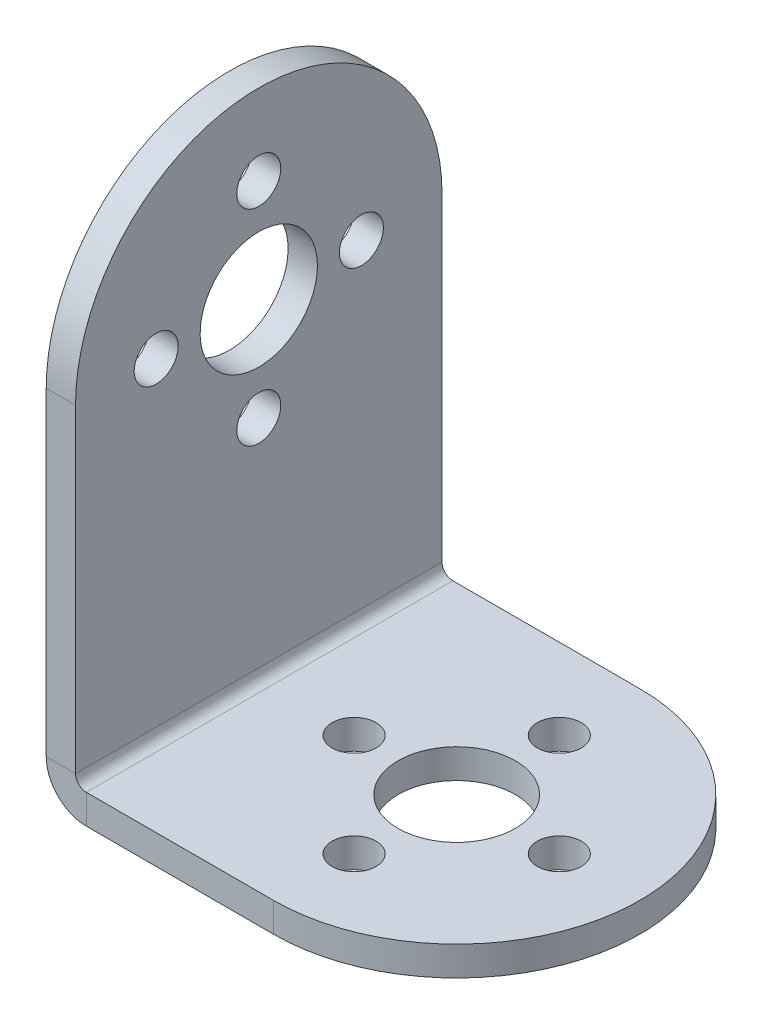
ISO-10303-21;
HEADER;
FILE_DESCRIPTION(('STEP AP214'),'2;1');
FILE_NAME('part.step','',(''),(''),'','','');
FILE_SCHEMA(('AUTOMOTIVE_DESIGN { 1 0 10303 214 1 1 1 1 }'));
ENDSEC;
DATA;
#1=APPLICATION_CONTEXT('core data for automotive mechanical design processes');
#2=APPLICATION_PROTOCOL_DEFINITION('international standard','automotive_design',2000,#1);
#3=PRODUCT_CONTEXT('',#1,'mechanical');
#4=PRODUCT('Part','Part','',(#3));
#5=PRODUCT_RELATED_PRODUCT_CATEGORY('part','',(#4));
#6=PRODUCT_DEFINITION_FORMATION('','',#4);
#7=PRODUCT_DEFINITION_CONTEXT('part definition',#1,'design');
#8=PRODUCT_DEFINITION('design','',#6,#7);
#9=PRODUCT_DEFINITION_SHAPE('','',#8);
#10=(LENGTH_UNIT() NAMED_UNIT(*) SI_UNIT(.MILLI.,.METRE.));
#11=(NAMED_UNIT(*) PLANE_ANGLE_UNIT() SI_UNIT($,.RADIAN.));
#12=(NAMED_UNIT(*) SI_UNIT($,.STERADIAN.) SOLID_ANGLE_UNIT());
#13=UNCERTAINTY_MEASURE_WITH_UNIT(LENGTH_MEASURE(1.E-05),#10,'distance_accuracy_value','');
#14=(GEOMETRIC_REPRESENTATION_CONTEXT(3) GLOBAL_UNCERTAINTY_ASSIGNED_CONTEXT((#13)) GLOBAL_UNIT_ASSIGNED_CONTEXT((#10,
#11,#12)) REPRESENTATION_CONTEXT('',''));
#15=CARTESIAN_POINT('',(0.,0.,0.));
#16=DIRECTION('',(0.,0.,1.));
#17=DIRECTION('',(1.,0.,0.));
#18=AXIS2_PLACEMENT_3D('',#15,#16,#17);
#19=CARTESIAN_POINT('',(-14.,0.,0.));
#20=DIRECTION('',(1.,0.,0.));
#21=DIRECTION('',(0.,1.,0.));
#22=AXIS2_PLACEMENT_3D('',#19,#20,#21);
#23=PLANE('',#22);
#24=CARTESIAN_POINT('',(-14.0000000000002,24.5,7.));
#25=DIRECTION('',(1.,0.,0.));
#26=DIRECTION('',(0.,1.,0.));
#27=AXIS2_PLACEMENT_3D('',#24,#25,#26);
#28=CIRCLE('',#27,1.5);
#29=CARTESIAN_POINT('',(-14.0000000000002,26.,7.));
#30=VERTEX_POINT('',#29);
#31=EDGE_CURVE('E475',#30,#30,#28,.T.);
#32=ORIENTED_EDGE('',*,*,#31,.T.);
#33=EDGE_LOOP('',(#32));
#34=FACE_BOUND('',#33,.T.);
#35=CARTESIAN_POINT('',(-14.0000000000002,17.5,0.));
#36=DIRECTION('',(1.,0.,0.));
#37=DIRECTION('',(0.,1.,0.));
#38=AXIS2_PLACEMENT_3D('',#35,#36,#37);
#39=CIRCLE('',#38,1.5);
#40=CARTESIAN_POINT('',(-14.0000000000002,19.,0.));
#41=VERTEX_POINT('',#40);
#42=EDGE_CURVE('E460',#41,#41,#39,.T.);
#43=ORIENTED_EDGE('',*,*,#42,.T.);
#44=EDGE_LOOP('',(#43));
#45=FACE_BOUND('',#44,.T.);
#46=CARTESIAN_POINT('',(-14.0000000000002,31.5,0.));
#47=DIRECTION('',(1.,0.,0.));
#48=DIRECTION('',(0.,1.,0.));
#49=AXIS2_PLACEMENT_3D('',#46,#47,#48);
#50=CIRCLE('',#49,1.5);
#51=CARTESIAN_POINT('',(-14.0000000000002,33.,0.));
#52=VERTEX_POINT('',#51);
#53=EDGE_CURVE('E444',#52,#52,#50,.T.);
#54=ORIENTED_EDGE('',*,*,#53,.T.);
#55=EDGE_LOOP('',(#54));
#56=FACE_BOUND('',#55,.T.);
#57=CARTESIAN_POINT('',(-14.0000000000002,24.5,-7.));
#58=DIRECTION('',(1.,0.,0.));
#59=DIRECTION('',(0.,1.,0.));
#60=AXIS2_PLACEMENT_3D('',#57,#58,#59);
#61=CIRCLE('',#60,1.5);
#62=CARTESIAN_POINT('',(-14.0000000000002,26.,-7.));
#63=VERTEX_POINT('',#62);
#64=EDGE_CURVE('E459',#63,#63,#61,.T.);
#65=ORIENTED_EDGE('',*,*,#64,.T.);
#66=EDGE_LOOP('',(#65));
#67=FACE_BOUND('',#66,.T.);
#68=CARTESIAN_POINT('',(-14.0000000000002,24.5,0.));
#69=DIRECTION('',(1.,0.,0.));
#70=DIRECTION('',(0.,1.,0.));
#71=AXIS2_PLACEMENT_3D('',#68,#69,#70);
#72=CIRCLE('',#71,4.);
#73=CARTESIAN_POINT('',(-14.0000000000002,28.5,0.));
#74=VERTEX_POINT('',#73);
#75=EDGE_CURVE('E451',#74,#74,#72,.T.);
#76=ORIENTED_EDGE('',*,*,#75,.T.);
#77=EDGE_LOOP('',(#76));
#78=FACE_BOUND('',#77,.T.);
#79=DIRECTION('',(0.,1.,0.));
#80=VECTOR('',#79,1.);
#81=CARTESIAN_POINT('',(-14.,0.,12.5));
#82=LINE('',#81,#80);
#83=CARTESIAN_POINT('',(-14.,2.73659999999999,12.5));
#84=VERTEX_POINT('',#83);
#85=CARTESIAN_POINT('',(-14.0000000000002,24.5,12.5));
#86=VERTEX_POINT('',#85);
#87=EDGE_CURVE('E290',#84,#86,#82,.T.);
#88=ORIENTED_EDGE('',*,*,#87,.T.);
#89=CARTESIAN_POINT('',(-14.0000000000002,24.5,0.));
#90=DIRECTION('',(1.,0.,0.));
#91=DIRECTION('',(0.,1.,0.));
#92=AXIS2_PLACEMENT_3D('',#89,#90,#91);
#93=CIRCLE('',#92,12.5);
#94=CARTESIAN_POINT('',(-14.0000000000002,24.5,-12.5));
#95=VERTEX_POINT('',#94);
#96=EDGE_CURVE('E369',#95,#86,#93,.T.);
#97=ORIENTED_EDGE('',*,*,#96,.F.);
#98=DIRECTION('',(0.,-1.,0.));
#99=VECTOR('',#98,1.);
#100=CARTESIAN_POINT('',(-14.,0.,-12.5));
#101=LINE('',#100,#99);
#102=CARTESIAN_POINT('',(-14.,2.73659999999999,-12.5));
#103=VERTEX_POINT('',#102);
#104=EDGE_CURVE('E280',#95,#103,#101,.T.);
#105=ORIENTED_EDGE('',*,*,#104,.T.);
#106=DIRECTION('',(0.,0.,1.));
#107=VECTOR('',#106,1.);
#108=CARTESIAN_POINT('',(-14.,2.73659999999999,-12.5));
#109=LINE('',#108,#107);
#110=EDGE_CURVE('E292',#84,#103,#109,.F.);
#111=ORIENTED_EDGE('',*,*,#110,.F.);
#112=EDGE_LOOP('',(#88,#97,#105,#111));
#113=FACE_BOUND('',#112,.T.);
#114=ADVANCED_FACE('F209',(#34,#45,#56,#67,#78,#113),#23,.F.);
#115=CARTESIAN_POINT('',(-12.,0.,0.));
#116=DIRECTION('',(1.,0.,0.));
#117=DIRECTION('',(0.,1.,0.));
#118=AXIS2_PLACEMENT_3D('',#115,#116,#117);
#119=PLANE('',#118);
#120=CARTESIAN_POINT('',(-12.0000000000001,24.5,7.));
#121=DIRECTION('',(1.,0.,0.));
#122=DIRECTION('',(0.,1.,0.));
#123=AXIS2_PLACEMENT_3D('',#120,#121,#122);
#124=CIRCLE('',#123,1.5);
#125=CARTESIAN_POINT('',(-12.0000000000001,26.,7.));
#126=VERTEX_POINT('',#125);
#127=EDGE_CURVE('E471',#126,#126,#124,.T.);
#128=ORIENTED_EDGE('',*,*,#127,.F.);
#129=EDGE_LOOP('',(#128));
#130=FACE_BOUND('',#129,.T.);
#131=CARTESIAN_POINT('',(-12.0000000000001,17.5,0.));
#132=DIRECTION('',(1.,0.,0.));
#133=DIRECTION('',(0.,1.,0.));
#134=AXIS2_PLACEMENT_3D('',#131,#132,#133);
#135=CIRCLE('',#134,1.5);
#136=CARTESIAN_POINT('',(-12.0000000000001,19.,0.));
#137=VERTEX_POINT('',#136);
#138=EDGE_CURVE('E479',#137,#137,#135,.T.);
#139=ORIENTED_EDGE('',*,*,#138,.F.);
#140=EDGE_LOOP('',(#139));
#141=FACE_BOUND('',#140,.T.);
#142=CARTESIAN_POINT('',(-12.0000000000001,31.5,0.));
#143=DIRECTION('',(1.,0.,0.));
#144=DIRECTION('',(0.,1.,0.));
#145=AXIS2_PLACEMENT_3D('',#142,#143,#144);
#146=CIRCLE('',#145,1.5);
#147=CARTESIAN_POINT('',(-12.0000000000001,33.,0.));
#148=VERTEX_POINT('',#147);
#149=EDGE_CURVE('E447',#148,#148,#146,.T.);
#150=ORIENTED_EDGE('',*,*,#149,.F.);
#151=EDGE_LOOP('',(#150));
#152=FACE_BOUND('',#151,.T.);
#153=CARTESIAN_POINT('',(-12.0000000000001,24.5,0.));
#154=DIRECTION('',(1.,0.,0.));
#155=DIRECTION('',(0.,1.,0.));
#156=AXIS2_PLACEMENT_3D('',#153,#154,#155);
#157=CIRCLE('',#156,4.);
#158=CARTESIAN_POINT('',(-12.0000000000001,28.5,0.));
#159=VERTEX_POINT('',#158);
#160=EDGE_CURVE('E464',#159,#159,#157,.T.);
#161=ORIENTED_EDGE('',*,*,#160,.F.);
#162=EDGE_LOOP('',(#161));
#163=FACE_BOUND('',#162,.T.);
#164=CARTESIAN_POINT('',(-12.0000000000001,24.5,-7.));
#165=DIRECTION('',(1.,0.,0.));
#166=DIRECTION('',(0.,1.,0.));
#167=AXIS2_PLACEMENT_3D('',#164,#165,#166);
#168=CIRCLE('',#167,1.5);
#169=CARTESIAN_POINT('',(-12.0000000000001,26.,-7.));
#170=VERTEX_POINT('',#169);
#171=EDGE_CURVE('E455',#170,#170,#168,.T.);
#172=ORIENTED_EDGE('',*,*,#171,.F.);
#173=EDGE_LOOP('',(#172));
#174=FACE_BOUND('',#173,.T.);
#175=CARTESIAN_POINT('',(-12.0000000000001,24.5,0.));
#176=DIRECTION('',(1.,0.,0.));
#177=DIRECTION('',(0.,1.,0.));
#178=AXIS2_PLACEMENT_3D('',#175,#176,#177);
#179=CIRCLE('',#178,12.5);
#180=CARTESIAN_POINT('',(-12.0000000000001,24.5,-12.5));
#181=VERTEX_POINT('',#180);
#182=CARTESIAN_POINT('',(-12.0000000000001,24.5,12.5));
#183=VERTEX_POINT('',#182);
#184=EDGE_CURVE('E297',#181,#183,#179,.T.);
#185=ORIENTED_EDGE('',*,*,#184,.T.);
#186=DIRECTION('',(0.,-1.,0.));
#187=VECTOR('',#186,1.);
#188=CARTESIAN_POINT('',(-12.0000000000001,37.,12.5));
#189=LINE('',#188,#187);
#190=CARTESIAN_POINT('',(-12.,2.7366,12.5));
#191=VERTEX_POINT('',#190);
#192=EDGE_CURVE('E288',#191,#183,#189,.F.);
#193=ORIENTED_EDGE('',*,*,#192,.F.);
#194=DIRECTION('',(0.,0.,1.));
#195=VECTOR('',#194,1.);
#196=CARTESIAN_POINT('',(-12.,2.7366,-12.5));
#197=LINE('',#196,#195);
#198=CARTESIAN_POINT('',(-12.,2.7366,-12.5));
#199=VERTEX_POINT('',#198);
#200=EDGE_CURVE('E256',#199,#191,#197,.T.);
#201=ORIENTED_EDGE('',*,*,#200,.F.);
#202=DIRECTION('',(0.,1.,0.));
#203=VECTOR('',#202,1.);
#204=CARTESIAN_POINT('',(-12.,2.,-12.5));
#205=LINE('',#204,#203);
#206=EDGE_CURVE('E300',#181,#199,#205,.F.);
#207=ORIENTED_EDGE('',*,*,#206,.F.);
#208=EDGE_LOOP('',(#185,#193,#201,#207));
#209=FACE_BOUND('',#208,.T.);
#210=ADVANCED_FACE('F295',(#130,#141,#152,#163,#174,#209),#119,.T.);
#211=CARTESIAN_POINT('',(-14.0000000000001,37.,12.5));
#212=DIRECTION('',(0.,0.,-1.));
#213=DIRECTION('',(-1.,0.,0.));
#214=AXIS2_PLACEMENT_3D('',#211,#212,#213);
#215=PLANE('',#214);
#216=DIRECTION('',(1.,0.,0.));
#217=VECTOR('',#216,1.);
#218=CARTESIAN_POINT('',(-14.0000000000002,24.5,12.5));
#219=LINE('',#218,#217);
#220=EDGE_CURVE('E439',#86,#183,#219,.T.);
#221=ORIENTED_EDGE('',*,*,#220,.F.);
#222=ORIENTED_EDGE('',*,*,#87,.F.);
#223=DIRECTION('',(1.,0.,0.));
#224=VECTOR('',#223,1.);
#225=CARTESIAN_POINT('',(-12.,2.7366,12.5));
#226=LINE('',#225,#224);
#227=EDGE_CURVE('E268',#191,#84,#226,.F.);
#228=ORIENTED_EDGE('',*,*,#227,.F.);
#229=ORIENTED_EDGE('',*,*,#192,.T.);
#230=EDGE_LOOP('',(#221,#222,#228,#229));
#231=FACE_BOUND('',#230,.T.);
#232=ADVANCED_FACE('F286',(#231),#215,.F.);
#233=CARTESIAN_POINT('',(0.,2.,0.));
#234=DIRECTION('',(0.,-1.,0.));
#235=DIRECTION('',(0.,0.,-1.));
#236=AXIS2_PLACEMENT_3D('',#233,#234,#235);
#237=PLANE('',#236);
#238=CARTESIAN_POINT('',(1.49999999999999,2.,0.));
#239=DIRECTION('',(0.,1.,0.));
#240=DIRECTION('',(0.,0.,1.));
#241=AXIS2_PLACEMENT_3D('',#238,#239,#240);
#242=CIRCLE('',#241,4.);
#243=CARTESIAN_POINT('',(1.49999999999999,2.,4.));
#244=VERTEX_POINT('',#243);
#245=EDGE_CURVE('E396',#244,#244,#242,.T.);
#246=ORIENTED_EDGE('',*,*,#245,.F.);
#247=EDGE_LOOP('',(#246));
#248=FACE_BOUND('',#247,.T.);
#249=CARTESIAN_POINT('',(1.49999999999999,2.,-7.));
#250=DIRECTION('',(0.,1.,0.));
#251=DIRECTION('',(0.,0.,1.));
#252=AXIS2_PLACEMENT_3D('',#249,#250,#251);
#253=CIRCLE('',#252,1.5);
#254=CARTESIAN_POINT('',(1.49999999999999,2.,-5.5));
#255=VERTEX_POINT('',#254);
#256=EDGE_CURVE('E397',#255,#255,#253,.T.);
#257=ORIENTED_EDGE('',*,*,#256,.F.);
#258=EDGE_LOOP('',(#257));
#259=FACE_BOUND('',#258,.T.);
#260=CARTESIAN_POINT('',(-5.50000000000001,2.,0.));
#261=DIRECTION('',(0.,1.,0.));
#262=DIRECTION('',(0.,0.,1.));
#263=AXIS2_PLACEMENT_3D('',#260,#261,#262);
#264=CIRCLE('',#263,1.5);
#265=CARTESIAN_POINT('',(-5.50000000000001,2.,1.5));
#266=VERTEX_POINT('',#265);
#267=EDGE_CURVE('E380',#266,#266,#264,.T.);
#268=ORIENTED_EDGE('',*,*,#267,.F.);
#269=EDGE_LOOP('',(#268));
#270=FACE_BOUND('',#269,.T.);
#271=CARTESIAN_POINT('',(1.49999999999999,2.,7.));
#272=DIRECTION('',(0.,1.,0.));
#273=DIRECTION('',(0.,0.,1.));
#274=AXIS2_PLACEMENT_3D('',#271,#272,#273);
#275=CIRCLE('',#274,1.5);
#276=CARTESIAN_POINT('',(1.49999999999999,2.,8.5));
#277=VERTEX_POINT('',#276);
#278=EDGE_CURVE('E381',#277,#277,#275,.T.);
#279=ORIENTED_EDGE('',*,*,#278,.F.);
#280=EDGE_LOOP('',(#279));
#281=FACE_BOUND('',#280,.T.);
#282=CARTESIAN_POINT('',(8.49999999999999,2.,0.));
#283=DIRECTION('',(0.,1.,0.));
#284=DIRECTION('',(0.,0.,1.));
#285=AXIS2_PLACEMENT_3D('',#282,#283,#284);
#286=CIRCLE('',#285,1.5);
#287=CARTESIAN_POINT('',(8.49999999999999,2.,1.5));
#288=VERTEX_POINT('',#287);
#289=EDGE_CURVE('E375',#288,#288,#286,.T.);
#290=ORIENTED_EDGE('',*,*,#289,.F.);
#291=EDGE_LOOP('',(#290));
#292=FACE_BOUND('',#291,.T.);
#293=DIRECTION('',(1.,0.,0.));
#294=VECTOR('',#293,1.);
#295=CARTESIAN_POINT('',(-14.,2.,12.5));
#296=LINE('',#295,#294);
#297=CARTESIAN_POINT('',(-11.2634,2.,12.5));
#298=VERTEX_POINT('',#297);
#299=CARTESIAN_POINT('',(1.49999999999999,2.,12.5));
#300=VERTEX_POINT('',#299);
#301=EDGE_CURVE('E13',#298,#300,#296,.T.);
#302=ORIENTED_EDGE('',*,*,#301,.T.);
#303=CARTESIAN_POINT('',(1.49999999999999,2.,0.));
#304=DIRECTION('',(0.,1.,0.));
#305=DIRECTION('',(0.,0.,1.));
#306=AXIS2_PLACEMENT_3D('',#303,#304,#305);
#307=CIRCLE('',#306,12.5);
#308=CARTESIAN_POINT('',(1.49999999999999,2.,-12.5));
#309=VERTEX_POINT('',#308);
#310=EDGE_CURVE('E357',#300,#309,#307,.T.);
#311=ORIENTED_EDGE('',*,*,#310,.T.);
#312=DIRECTION('',(-1.,0.,0.));
#313=VECTOR('',#312,1.);
#314=CARTESIAN_POINT('',(-14.,2.,-12.5));
#315=LINE('',#314,#313);
#316=CARTESIAN_POINT('',(-11.2634,2.,-12.5));
#317=VERTEX_POINT('',#316);
#318=EDGE_CURVE('E219',#309,#317,#315,.T.);
#319=ORIENTED_EDGE('',*,*,#318,.T.);
#320=DIRECTION('',(0.,0.,1.));
#321=VECTOR('',#320,1.);
#322=CARTESIAN_POINT('',(-11.2634,2.,12.5));
#323=LINE('',#322,#321);
#324=EDGE_CURVE('E279',#298,#317,#323,.F.);
#325=ORIENTED_EDGE('',*,*,#324,.F.);
#326=EDGE_LOOP('',(#302,#311,#319,#325));
#327=FACE_BOUND('',#326,.T.);
#328=ADVANCED_FACE('F535',(#248,#259,#270,#281,#292,#327),#237,.F.);
#329=CARTESIAN_POINT('',(0.,0.,0.));
#330=DIRECTION('',(0.,-1.,0.));
#331=DIRECTION('',(0.,0.,-1.));
#332=AXIS2_PLACEMENT_3D('',#329,#330,#331);
#333=PLANE('',#332);
#334=CARTESIAN_POINT('',(8.49999999999999,0.,0.));
#335=DIRECTION('',(0.,1.,0.));
#336=DIRECTION('',(0.,0.,1.));
#337=AXIS2_PLACEMENT_3D('',#334,#335,#336);
#338=CIRCLE('',#337,1.5);
#339=CARTESIAN_POINT('',(8.49999999999999,0.,1.5));
#340=VERTEX_POINT('',#339);
#341=EDGE_CURVE('E385',#340,#340,#338,.T.);
#342=ORIENTED_EDGE('',*,*,#341,.T.);
#343=EDGE_LOOP('',(#342));
#344=FACE_BOUND('',#343,.T.);
#345=CARTESIAN_POINT('',(1.49999999999999,0.,7.));
#346=DIRECTION('',(0.,1.,0.));
#347=DIRECTION('',(0.,0.,1.));
#348=AXIS2_PLACEMENT_3D('',#345,#346,#347);
#349=CIRCLE('',#348,1.5);
#350=CARTESIAN_POINT('',(1.49999999999999,0.,8.5));
#351=VERTEX_POINT('',#350);
#352=EDGE_CURVE('E376',#351,#351,#349,.T.);
#353=ORIENTED_EDGE('',*,*,#352,.T.);
#354=EDGE_LOOP('',(#353));
#355=FACE_BOUND('',#354,.T.);
#356=CARTESIAN_POINT('',(-5.50000000000001,0.,0.));
#357=DIRECTION('',(0.,1.,0.));
#358=DIRECTION('',(0.,0.,1.));
#359=AXIS2_PLACEMENT_3D('',#356,#357,#358);
#360=CIRCLE('',#359,1.5);
#361=CARTESIAN_POINT('',(-5.50000000000001,0.,1.5));
#362=VERTEX_POINT('',#361);
#363=EDGE_CURVE('E401',#362,#362,#360,.T.);
#364=ORIENTED_EDGE('',*,*,#363,.T.);
#365=EDGE_LOOP('',(#364));
#366=FACE_BOUND('',#365,.T.);
#367=CARTESIAN_POINT('',(1.49999999999999,0.,-7.));
#368=DIRECTION('',(0.,1.,0.));
#369=DIRECTION('',(0.,0.,1.));
#370=AXIS2_PLACEMENT_3D('',#367,#368,#369);
#371=CIRCLE('',#370,1.5);
#372=CARTESIAN_POINT('',(1.49999999999999,0.,-5.5));
#373=VERTEX_POINT('',#372);
#374=EDGE_CURVE('E392',#373,#373,#371,.T.);
#375=ORIENTED_EDGE('',*,*,#374,.T.);
#376=EDGE_LOOP('',(#375));
#377=FACE_BOUND('',#376,.T.);
#378=CARTESIAN_POINT('',(1.49999999999999,0.,0.));
#379=DIRECTION('',(0.,1.,0.));
#380=DIRECTION('',(0.,0.,1.));
#381=AXIS2_PLACEMENT_3D('',#378,#379,#380);
#382=CIRCLE('',#381,4.);
#383=CARTESIAN_POINT('',(1.49999999999999,0.,4.));
#384=VERTEX_POINT('',#383);
#385=EDGE_CURVE('E312',#384,#384,#382,.T.);
#386=ORIENTED_EDGE('',*,*,#385,.T.);
#387=EDGE_LOOP('',(#386));
#388=FACE_BOUND('',#387,.T.);
#389=CARTESIAN_POINT('',(1.49999999999999,0.,0.));
#390=DIRECTION('',(0.,1.,0.));
#391=DIRECTION('',(0.,0.,1.));
#392=AXIS2_PLACEMENT_3D('',#389,#390,#391);
#393=CIRCLE('',#392,12.5);
#394=CARTESIAN_POINT('',(1.49999999999999,0.,12.5));
#395=VERTEX_POINT('',#394);
#396=CARTESIAN_POINT('',(1.49999999999999,0.,-12.5));
#397=VERTEX_POINT('',#396);
#398=EDGE_CURVE('E351',#395,#397,#393,.T.);
#399=ORIENTED_EDGE('',*,*,#398,.F.);
#400=DIRECTION('',(1.,0.,0.));
#401=VECTOR('',#400,1.);
#402=CARTESIAN_POINT('',(-14.,0.,12.5));
#403=LINE('',#402,#401);
#404=CARTESIAN_POINT('',(-11.2634,0.,12.5));
#405=VERTEX_POINT('',#404);
#406=EDGE_CURVE('E213',#405,#395,#403,.T.);
#407=ORIENTED_EDGE('',*,*,#406,.F.);
#408=DIRECTION('',(0.,0.,1.));
#409=VECTOR('',#408,1.);
#410=CARTESIAN_POINT('',(-11.2634,0.,12.5));
#411=LINE('',#410,#409);
#412=CARTESIAN_POINT('',(-11.2634,0.,-12.5));
#413=VERTEX_POINT('',#412);
#414=EDGE_CURVE('E235',#405,#413,#411,.F.);
#415=ORIENTED_EDGE('',*,*,#414,.T.);
#416=DIRECTION('',(-1.,0.,0.));
#417=VECTOR('',#416,1.);
#418=CARTESIAN_POINT('',(-14.,0.,-12.5));
#419=LINE('',#418,#417);
#420=EDGE_CURVE('E227',#397,#413,#419,.T.);
#421=ORIENTED_EDGE('',*,*,#420,.F.);
#422=EDGE_LOOP('',(#399,#407,#415,#421));
#423=FACE_BOUND('',#422,.T.);
#424=ADVANCED_FACE('F349',(#344,#355,#366,#377,#388,#423),#333,.T.);
#425=CARTESIAN_POINT('',(-14.,2.,-12.5));
#426=DIRECTION('',(0.,0.,1.));
#427=DIRECTION('',(1.,0.,0.));
#428=AXIS2_PLACEMENT_3D('',#425,#426,#427);
#429=PLANE('',#428);
#430=DIRECTION('',(0.,1.,0.));
#431=VECTOR('',#430,1.);
#432=CARTESIAN_POINT('',(1.49999999999999,0.,-12.5));
#433=LINE('',#432,#431);
#434=EDGE_CURVE('E356',#397,#309,#433,.T.);
#435=ORIENTED_EDGE('',*,*,#434,.F.);
#436=ORIENTED_EDGE('',*,*,#420,.T.);
#437=DIRECTION('',(0.,-1.,0.));
#438=VECTOR('',#437,1.);
#439=CARTESIAN_POINT('',(-11.2634,2.,-12.5));
#440=LINE('',#439,#438);
#441=EDGE_CURVE('E326',#317,#413,#440,.T.);
#442=ORIENTED_EDGE('',*,*,#441,.F.);
#443=ORIENTED_EDGE('',*,*,#318,.F.);
#444=EDGE_LOOP('',(#435,#436,#442,#443));
#445=FACE_BOUND('',#444,.T.);
#446=ADVANCED_FACE('F211',(#445),#429,.F.);
#447=CARTESIAN_POINT('',(-14.,2.,12.5));
#448=DIRECTION('',(0.,0.,-1.));
#449=DIRECTION('',(-1.,0.,0.));
#450=AXIS2_PLACEMENT_3D('',#447,#448,#449);
#451=PLANE('',#450);
#452=ORIENTED_EDGE('',*,*,#406,.T.);
#453=DIRECTION('',(0.,1.,0.));
#454=VECTOR('',#453,1.);
#455=CARTESIAN_POINT('',(1.49999999999999,0.,12.5));
#456=LINE('',#455,#454);
#457=EDGE_CURVE('E344',#395,#300,#456,.T.);
#458=ORIENTED_EDGE('',*,*,#457,.T.);
#459=ORIENTED_EDGE('',*,*,#301,.F.);
#460=DIRECTION('',(0.,-1.,0.));
#461=VECTOR('',#460,1.);
#462=CARTESIAN_POINT('',(-11.2634,2.,12.5));
#463=LINE('',#462,#461);
#464=EDGE_CURVE('E277',#298,#405,#463,.T.);
#465=ORIENTED_EDGE('',*,*,#464,.T.);
#466=EDGE_LOOP('',(#452,#458,#459,#465));
#467=FACE_BOUND('',#466,.T.);
#468=ADVANCED_FACE('F340',(#467),#451,.F.);
#469=CARTESIAN_POINT('',(-11.2634,2.7366,-12.5));
#470=DIRECTION('',(0.,0.,-1.));
#471=DIRECTION('',(-1.,0.,0.));
#472=AXIS2_PLACEMENT_3D('',#469,#470,#471);
#473=PLANE('',#472);
#474=DIRECTION('',(1.,0.,0.));
#475=VECTOR('',#474,1.);
#476=CARTESIAN_POINT('',(-14.,2.73659999999999,-12.5));
#477=LINE('',#476,#475);
#478=EDGE_CURVE('E269',#199,#103,#477,.F.);
#479=ORIENTED_EDGE('',*,*,#478,.F.);
#480=CARTESIAN_POINT('',(-11.2634,2.7366,-12.5));
#481=DIRECTION('',(0.,0.,1.));
#482=DIRECTION('',(1.,0.,0.));
#483=AXIS2_PLACEMENT_3D('',#480,#481,#482);
#484=CIRCLE('',#483,0.7366);
#485=EDGE_CURVE('E263',#317,#199,#484,.F.);
#486=ORIENTED_EDGE('',*,*,#485,.F.);
#487=ORIENTED_EDGE('',*,*,#441,.T.);
#488=CARTESIAN_POINT('',(-11.2634,2.7366,-12.5));
#489=DIRECTION('',(0.,0.,1.));
#490=DIRECTION('',(1.,0.,0.));
#491=AXIS2_PLACEMENT_3D('',#488,#489,#490);
#492=CIRCLE('',#491,2.7366);
#493=EDGE_CURVE('E315',#413,#103,#492,.F.);
#494=ORIENTED_EDGE('',*,*,#493,.T.);
#495=EDGE_LOOP('',(#479,#486,#487,#494));
#496=FACE_BOUND('',#495,.T.);
#497=ADVANCED_FACE('F435',(#496),#473,.T.);
#498=CARTESIAN_POINT('',(-11.2634,2.7366,12.5));
#499=DIRECTION('',(0.,0.,-1.));
#500=DIRECTION('',(-1.,0.,0.));
#501=AXIS2_PLACEMENT_3D('',#498,#499,#500);
#502=PLANE('',#501);
#503=CARTESIAN_POINT('',(-11.2634,2.7366,12.5));
#504=DIRECTION('',(0.,0.,1.));
#505=DIRECTION('',(1.,0.,0.));
#506=AXIS2_PLACEMENT_3D('',#503,#504,#505);
#507=CIRCLE('',#506,0.7366);
#508=EDGE_CURVE('E260',#191,#298,#507,.T.);
#509=ORIENTED_EDGE('',*,*,#508,.F.);
#510=ORIENTED_EDGE('',*,*,#227,.T.);
#511=CARTESIAN_POINT('',(-11.2634,2.7366,12.5));
#512=DIRECTION('',(0.,0.,1.));
#513=DIRECTION('',(1.,0.,0.));
#514=AXIS2_PLACEMENT_3D('',#511,#512,#513);
#515=CIRCLE('',#514,2.7366);
#516=EDGE_CURVE('E316',#84,#405,#515,.T.);
#517=ORIENTED_EDGE('',*,*,#516,.T.);
#518=ORIENTED_EDGE('',*,*,#464,.F.);
#519=EDGE_LOOP('',(#509,#510,#517,#518));
#520=FACE_BOUND('',#519,.T.);
#521=ADVANCED_FACE('F274',(#520),#502,.F.);
#522=CARTESIAN_POINT('',(-11.2634,2.7366,12.5));
#523=DIRECTION('',(0.,0.,1.));
#524=DIRECTION('',(-1.,0.,0.));
#525=AXIS2_PLACEMENT_3D('',#522,#523,#524);
#526=CYLINDRICAL_SURFACE('',#525,2.7366);
#527=ORIENTED_EDGE('',*,*,#414,.F.);
#528=ORIENTED_EDGE('',*,*,#516,.F.);
#529=ORIENTED_EDGE('',*,*,#110,.T.);
#530=ORIENTED_EDGE('',*,*,#493,.F.);
#531=EDGE_LOOP('',(#527,#528,#529,#530));
#532=FACE_BOUND('',#531,.T.);
#533=ADVANCED_FACE('F432',(#532),#526,.T.);
#534=CARTESIAN_POINT('',(-11.2634,2.7366,12.5));
#535=DIRECTION('',(0.,0.,1.));
#536=DIRECTION('',(-1.,0.,0.));
#537=AXIS2_PLACEMENT_3D('',#534,#535,#536);
#538=CYLINDRICAL_SURFACE('',#537,0.7366);
#539=ORIENTED_EDGE('',*,*,#324,.T.);
#540=ORIENTED_EDGE('',*,*,#485,.T.);
#541=ORIENTED_EDGE('',*,*,#200,.T.);
#542=ORIENTED_EDGE('',*,*,#508,.T.);
#543=EDGE_LOOP('',(#539,#540,#541,#542));
#544=FACE_BOUND('',#543,.T.);
#545=ADVANCED_FACE('F259',(#544),#538,.F.);
#546=CARTESIAN_POINT('',(-14.,1.99999999999999,-12.5));
#547=DIRECTION('',(0.,0.,1.));
#548=DIRECTION('',(1.,0.,0.));
#549=AXIS2_PLACEMENT_3D('',#546,#547,#548);
#550=PLANE('',#549);
#551=ORIENTED_EDGE('',*,*,#104,.F.);
#552=DIRECTION('',(1.,0.,0.));
#553=VECTOR('',#552,1.);
#554=CARTESIAN_POINT('',(-14.0000000000002,24.5,-12.5));
#555=LINE('',#554,#553);
#556=EDGE_CURVE('E363',#95,#181,#555,.T.);
#557=ORIENTED_EDGE('',*,*,#556,.T.);
#558=ORIENTED_EDGE('',*,*,#206,.T.);
#559=ORIENTED_EDGE('',*,*,#478,.T.);
#560=EDGE_LOOP('',(#551,#557,#558,#559));
#561=FACE_BOUND('',#560,.T.);
#562=ADVANCED_FACE('F437',(#561),#550,.F.);
#563=CARTESIAN_POINT('',(1.49999999999999,0.,0.));
#564=DIRECTION('',(0.,1.,0.));
#565=DIRECTION('',(0.,0.,1.));
#566=AXIS2_PLACEMENT_3D('',#563,#564,#565);
#567=CYLINDRICAL_SURFACE('',#566,12.5);
#568=ORIENTED_EDGE('',*,*,#310,.F.);
#569=ORIENTED_EDGE('',*,*,#457,.F.);
#570=ORIENTED_EDGE('',*,*,#398,.T.);
#571=ORIENTED_EDGE('',*,*,#434,.T.);
#572=EDGE_LOOP('',(#568,#569,#570,#571));
#573=FACE_BOUND('',#572,.T.);
#574=ADVANCED_FACE('F360',(#573),#567,.T.);
#575=CARTESIAN_POINT('',(1.49999999999999,0.,0.));
#576=DIRECTION('',(0.,1.,0.));
#577=DIRECTION('',(0.,0.,1.));
#578=AXIS2_PLACEMENT_3D('',#575,#576,#577);
#579=CYLINDRICAL_SURFACE('',#578,4.);
#580=ORIENTED_EDGE('',*,*,#385,.F.);
#581=EDGE_LOOP('',(#580));
#582=FACE_BOUND('',#581,.T.);
#583=ORIENTED_EDGE('',*,*,#245,.T.);
#584=EDGE_LOOP('',(#583));
#585=FACE_BOUND('',#584,.T.);
#586=ADVANCED_FACE('F528',(#582,#585),#579,.F.);
#587=CARTESIAN_POINT('',(1.49999999999999,0.,-7.));
#588=DIRECTION('',(0.,1.,0.));
#589=DIRECTION('',(0.,0.,1.));
#590=AXIS2_PLACEMENT_3D('',#587,#588,#589);
#591=CYLINDRICAL_SURFACE('',#590,1.5);
#592=ORIENTED_EDGE('',*,*,#374,.F.);
#593=EDGE_LOOP('',(#592));
#594=FACE_BOUND('',#593,.T.);
#595=ORIENTED_EDGE('',*,*,#256,.T.);
#596=EDGE_LOOP('',(#595));
#597=FACE_BOUND('',#596,.T.);
#598=ADVANCED_FACE('F614',(#594,#597),#591,.F.);
#599=CARTESIAN_POINT('',(-5.50000000000001,0.,0.));
#600=DIRECTION('',(0.,1.,0.));
#601=DIRECTION('',(0.,0.,1.));
#602=AXIS2_PLACEMENT_3D('',#599,#600,#601);
#603=CYLINDRICAL_SURFACE('',#602,1.5);
#604=ORIENTED_EDGE('',*,*,#363,.F.);
#605=EDGE_LOOP('',(#604));
#606=FACE_BOUND('',#605,.T.);
#607=ORIENTED_EDGE('',*,*,#267,.T.);
#608=EDGE_LOOP('',(#607));
#609=FACE_BOUND('',#608,.T.);
#610=ADVANCED_FACE('F603',(#606,#609),#603,.F.);
#611=CARTESIAN_POINT('',(1.49999999999999,0.,7.));
#612=DIRECTION('',(0.,1.,0.));
#613=DIRECTION('',(0.,0.,1.));
#614=AXIS2_PLACEMENT_3D('',#611,#612,#613);
#615=CYLINDRICAL_SURFACE('',#614,1.5);
#616=ORIENTED_EDGE('',*,*,#352,.F.);
#617=EDGE_LOOP('',(#616));
#618=FACE_BOUND('',#617,.T.);
#619=ORIENTED_EDGE('',*,*,#278,.T.);
#620=EDGE_LOOP('',(#619));
#621=FACE_BOUND('',#620,.T.);
#622=ADVANCED_FACE('F592',(#618,#621),#615,.F.);
#623=CARTESIAN_POINT('',(8.49999999999999,0.,0.));
#624=DIRECTION('',(0.,1.,0.));
#625=DIRECTION('',(0.,0.,1.));
#626=AXIS2_PLACEMENT_3D('',#623,#624,#625);
#627=CYLINDRICAL_SURFACE('',#626,1.5);
#628=ORIENTED_EDGE('',*,*,#341,.F.);
#629=EDGE_LOOP('',(#628));
#630=FACE_BOUND('',#629,.T.);
#631=ORIENTED_EDGE('',*,*,#289,.T.);
#632=EDGE_LOOP('',(#631));
#633=FACE_BOUND('',#632,.T.);
#634=ADVANCED_FACE('F518',(#630,#633),#627,.F.);
#635=CARTESIAN_POINT('',(-14.0000000000002,24.5,0.));
#636=DIRECTION('',(1.,0.,0.));
#637=DIRECTION('',(0.,1.,0.));
#638=AXIS2_PLACEMENT_3D('',#635,#636,#637);
#639=CYLINDRICAL_SURFACE('',#638,12.5);
#640=ORIENTED_EDGE('',*,*,#184,.F.);
#641=ORIENTED_EDGE('',*,*,#556,.F.);
#642=ORIENTED_EDGE('',*,*,#96,.T.);
#643=ORIENTED_EDGE('',*,*,#220,.T.);
#644=EDGE_LOOP('',(#640,#641,#642,#643));
#645=FACE_BOUND('',#644,.T.);
#646=ADVANCED_FACE('F438',(#645),#639,.T.);
#647=CARTESIAN_POINT('',(-14.0000000000002,24.5,-7.));
#648=DIRECTION('',(1.,0.,0.));
#649=DIRECTION('',(0.,1.,0.));
#650=AXIS2_PLACEMENT_3D('',#647,#648,#649);
#651=CYLINDRICAL_SURFACE('',#650,1.5);
#652=ORIENTED_EDGE('',*,*,#64,.F.);
#653=EDGE_LOOP('',(#652));
#654=FACE_BOUND('',#653,.T.);
#655=ORIENTED_EDGE('',*,*,#171,.T.);
#656=EDGE_LOOP('',(#655));
#657=FACE_BOUND('',#656,.T.);
#658=ADVANCED_FACE('F507',(#654,#657),#651,.F.);
#659=CARTESIAN_POINT('',(-14.0000000000002,24.5,0.));
#660=DIRECTION('',(1.,0.,0.));
#661=DIRECTION('',(0.,1.,0.));
#662=AXIS2_PLACEMENT_3D('',#659,#660,#661);
#663=CYLINDRICAL_SURFACE('',#662,4.);
#664=ORIENTED_EDGE('',*,*,#75,.F.);
#665=EDGE_LOOP('',(#664));
#666=FACE_BOUND('',#665,.T.);
#667=ORIENTED_EDGE('',*,*,#160,.T.);
#668=EDGE_LOOP('',(#667));
#669=FACE_BOUND('',#668,.T.);
#670=ADVANCED_FACE('F509',(#666,#669),#663,.F.);
#671=CARTESIAN_POINT('',(-14.0000000000002,31.5,0.));
#672=DIRECTION('',(1.,0.,0.));
#673=DIRECTION('',(0.,1.,0.));
#674=AXIS2_PLACEMENT_3D('',#671,#672,#673);
#675=CYLINDRICAL_SURFACE('',#674,1.5);
#676=ORIENTED_EDGE('',*,*,#53,.F.);
#677=EDGE_LOOP('',(#676));
#678=FACE_BOUND('',#677,.T.);
#679=ORIENTED_EDGE('',*,*,#149,.T.);
#680=EDGE_LOOP('',(#679));
#681=FACE_BOUND('',#680,.T.);
#682=ADVANCED_FACE('F493',(#678,#681),#675,.F.);
#683=CARTESIAN_POINT('',(-14.0000000000002,17.5,0.));
#684=DIRECTION('',(1.,0.,0.));
#685=DIRECTION('',(0.,1.,0.));
#686=AXIS2_PLACEMENT_3D('',#683,#684,#685);
#687=CYLINDRICAL_SURFACE('',#686,1.5);
#688=ORIENTED_EDGE('',*,*,#42,.F.);
#689=EDGE_LOOP('',(#688));
#690=FACE_BOUND('',#689,.T.);
#691=ORIENTED_EDGE('',*,*,#138,.T.);
#692=EDGE_LOOP('',(#691));
#693=FACE_BOUND('',#692,.T.);
#694=ADVANCED_FACE('F489',(#690,#693),#687,.F.);
#695=CARTESIAN_POINT('',(-14.0000000000002,24.5,7.));
#696=DIRECTION('',(1.,0.,0.));
#697=DIRECTION('',(0.,1.,0.));
#698=AXIS2_PLACEMENT_3D('',#695,#696,#697);
#699=CYLINDRICAL_SURFACE('',#698,1.5);
#700=ORIENTED_EDGE('',*,*,#31,.F.);
#701=EDGE_LOOP('',(#700));
#702=FACE_BOUND('',#701,.T.);
#703=ORIENTED_EDGE('',*,*,#127,.T.);
#704=EDGE_LOOP('',(#703));
#705=FACE_BOUND('',#704,.T.);
#706=ADVANCED_FACE('F492',(#702,#705),#699,.F.);
#707=CLOSED_SHELL('',(#114,#210,#232,#328,#424,#446,#468,#497,#521,#533,#545,#562,#574,#586,
#598,#610,#622,#634,#646,#658,#670,#682,#694,#706));
#708=MANIFOLD_SOLID_BREP('B2',#707);
#709=ADVANCED_BREP_SHAPE_REPRESENTATION('',(#18,#708),#14);
#710=SHAPE_DEFINITION_REPRESENTATION(#9,#709);
ENDSEC;
END-ISO-10303-21;
